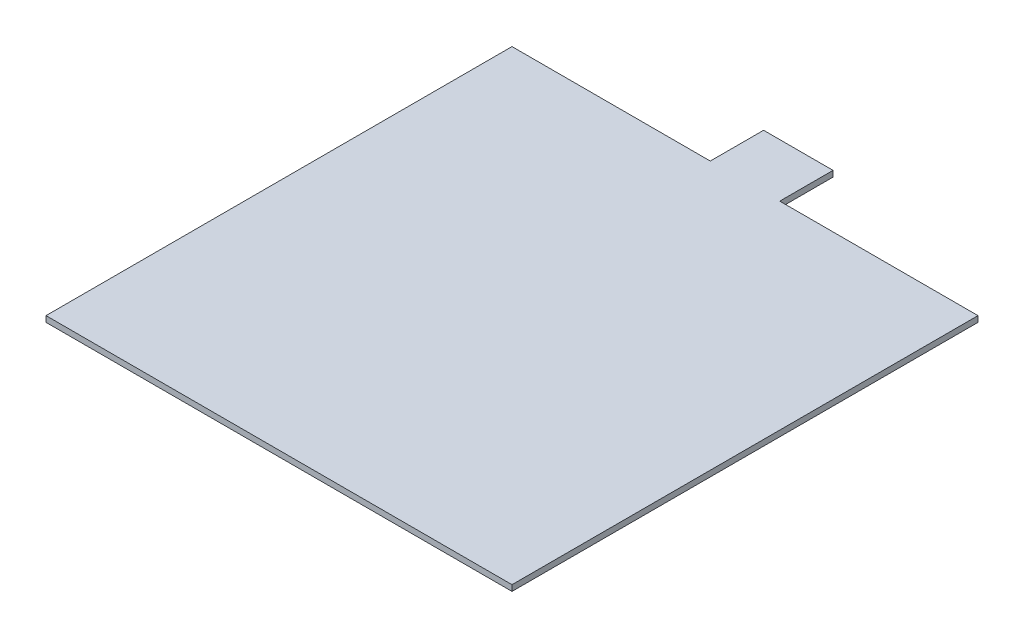
ISO-10303-21;
HEADER;
FILE_DESCRIPTION(('STEP AP214'),'2;1');
FILE_NAME('part.step','',(''),(''),'','','');
FILE_SCHEMA(('AUTOMOTIVE_DESIGN { 1 0 10303 214 1 1 1 1 }'));
ENDSEC;
DATA;
#1=APPLICATION_CONTEXT('core data for automotive mechanical design processes');
#2=APPLICATION_PROTOCOL_DEFINITION('international standard','automotive_design',2000,#1);
#3=PRODUCT_CONTEXT('',#1,'mechanical');
#4=PRODUCT('Part','Part','',(#3));
#5=PRODUCT_RELATED_PRODUCT_CATEGORY('part','',(#4));
#6=PRODUCT_DEFINITION_FORMATION('','',#4);
#7=PRODUCT_DEFINITION_CONTEXT('part definition',#1,'design');
#8=PRODUCT_DEFINITION('design','',#6,#7);
#9=PRODUCT_DEFINITION_SHAPE('','',#8);
#10=(LENGTH_UNIT() NAMED_UNIT(*) SI_UNIT(.MILLI.,.METRE.));
#11=(NAMED_UNIT(*) PLANE_ANGLE_UNIT() SI_UNIT($,.RADIAN.));
#12=(NAMED_UNIT(*) SI_UNIT($,.STERADIAN.) SOLID_ANGLE_UNIT());
#13=UNCERTAINTY_MEASURE_WITH_UNIT(LENGTH_MEASURE(1.E-05),#10,'distance_accuracy_value','');
#14=(GEOMETRIC_REPRESENTATION_CONTEXT(3) GLOBAL_UNCERTAINTY_ASSIGNED_CONTEXT((#13)) GLOBAL_UNIT_ASSIGNED_CONTEXT((#10,
#11,#12)) REPRESENTATION_CONTEXT('',''));
#15=CARTESIAN_POINT('',(0.,0.,0.));
#16=DIRECTION('',(0.,0.,1.));
#17=DIRECTION('',(1.,0.,0.));
#18=AXIS2_PLACEMENT_3D('',#15,#16,#17);
#19=CARTESIAN_POINT('',(-21.85,0.55,-21.85));
#20=DIRECTION('',(0.,0.,1.));
#21=DIRECTION('',(1.,0.,0.));
#22=AXIS2_PLACEMENT_3D('',#19,#20,#21);
#23=PLANE('',#22);
#24=DIRECTION('',(0.,-1.,0.));
#25=VECTOR('',#24,1.);
#26=CARTESIAN_POINT('',(3.2563817456186,0.55,-21.85));
#27=LINE('',#26,#25);
#28=CARTESIAN_POINT('',(3.2563817456186,0.55,-21.85));
#29=VERTEX_POINT('',#28);
#30=CARTESIAN_POINT('',(3.2563817456186,0.,-21.85));
#31=VERTEX_POINT('',#30);
#32=EDGE_CURVE('E137',#29,#31,#27,.T.);
#33=ORIENTED_EDGE('',*,*,#32,.F.);
#34=DIRECTION('',(-1.,0.,0.));
#35=VECTOR('',#34,1.);
#36=CARTESIAN_POINT('',(-21.85,0.55,-21.85));
#37=LINE('',#36,#35);
#38=CARTESIAN_POINT('',(21.85,0.55,-21.85));
#39=VERTEX_POINT('',#38);
#40=EDGE_CURVE('E96',#39,#29,#37,.T.);
#41=ORIENTED_EDGE('',*,*,#40,.F.);
#42=DIRECTION('',(0.,-1.,0.));
#43=VECTOR('',#42,1.);
#44=CARTESIAN_POINT('',(21.85,0.55,-21.85));
#45=LINE('',#44,#43);
#46=CARTESIAN_POINT('',(21.85,0.,-21.85));
#47=VERTEX_POINT('',#46);
#48=EDGE_CURVE('E11',#39,#47,#45,.T.);
#49=ORIENTED_EDGE('',*,*,#48,.T.);
#50=DIRECTION('',(-1.,0.,0.));
#51=VECTOR('',#50,1.);
#52=CARTESIAN_POINT('',(-21.85,0.,-21.85));
#53=LINE('',#52,#51);
#54=EDGE_CURVE('E159',#47,#31,#53,.T.);
#55=ORIENTED_EDGE('',*,*,#54,.T.);
#56=EDGE_LOOP('',(#33,#41,#49,#55));
#57=FACE_BOUND('',#56,.T.);
#58=ADVANCED_FACE('F43',(#57),#23,.F.);
#59=CARTESIAN_POINT('',(21.85,0.55,21.85));
#60=DIRECTION('',(-1.,0.,0.));
#61=DIRECTION('',(0.,0.,1.));
#62=AXIS2_PLACEMENT_3D('',#59,#60,#61);
#63=PLANE('',#62);
#64=DIRECTION('',(0.,0.,-1.));
#65=VECTOR('',#64,1.);
#66=CARTESIAN_POINT('',(21.85,0.,21.85));
#67=LINE('',#66,#65);
#68=CARTESIAN_POINT('',(21.85,0.,21.85));
#69=VERTEX_POINT('',#68);
#70=EDGE_CURVE('E136',#69,#47,#67,.T.);
#71=ORIENTED_EDGE('',*,*,#70,.T.);
#72=ORIENTED_EDGE('',*,*,#48,.F.);
#73=DIRECTION('',(0.,0.,-1.));
#74=VECTOR('',#73,1.);
#75=CARTESIAN_POINT('',(21.85,0.55,21.85));
#76=LINE('',#75,#74);
#77=CARTESIAN_POINT('',(21.85,0.55,21.85));
#78=VERTEX_POINT('',#77);
#79=EDGE_CURVE('E143',#78,#39,#76,.T.);
#80=ORIENTED_EDGE('',*,*,#79,.F.);
#81=DIRECTION('',(0.,-1.,0.));
#82=VECTOR('',#81,1.);
#83=CARTESIAN_POINT('',(21.85,0.55,21.85));
#84=LINE('',#83,#82);
#85=EDGE_CURVE('E154',#78,#69,#84,.T.);
#86=ORIENTED_EDGE('',*,*,#85,.T.);
#87=EDGE_LOOP('',(#71,#72,#80,#86));
#88=FACE_BOUND('',#87,.T.);
#89=ADVANCED_FACE('F45',(#88),#63,.F.);
#90=CARTESIAN_POINT('',(-3.2563817456186,0.55,-21.85));
#91=VERTEX_POINT('',#90);
#92=CARTESIAN_POINT('',(-21.85,0.55,-21.85));
#93=VERTEX_POINT('',#92);
#94=EDGE_CURVE('E122',#91,#93,#37,.T.);
#95=ORIENTED_EDGE('',*,*,#94,.F.);
#96=DIRECTION('',(0.,-1.,0.));
#97=VECTOR('',#96,1.);
#98=CARTESIAN_POINT('',(-3.2563817456186,0.55,-21.85));
#99=LINE('',#98,#97);
#100=CARTESIAN_POINT('',(-3.2563817456186,0.,-21.85));
#101=VERTEX_POINT('',#100);
#102=EDGE_CURVE('E131',#91,#101,#99,.T.);
#103=ORIENTED_EDGE('',*,*,#102,.T.);
#104=CARTESIAN_POINT('',(-21.85,0.,-21.85));
#105=VERTEX_POINT('',#104);
#106=EDGE_CURVE('E158',#101,#105,#53,.T.);
#107=ORIENTED_EDGE('',*,*,#106,.T.);
#108=DIRECTION('',(0.,-1.,0.));
#109=VECTOR('',#108,1.);
#110=CARTESIAN_POINT('',(-21.85,0.55,-21.85));
#111=LINE('',#110,#109);
#112=EDGE_CURVE('E52',#93,#105,#111,.T.);
#113=ORIENTED_EDGE('',*,*,#112,.F.);
#114=EDGE_LOOP('',(#95,#103,#107,#113));
#115=FACE_BOUND('',#114,.T.);
#116=ADVANCED_FACE('F139',(#115),#23,.F.);
#117=CARTESIAN_POINT('',(-21.85,0.55,21.85));
#118=DIRECTION('',(1.,0.,0.));
#119=DIRECTION('',(0.,0.,-1.));
#120=AXIS2_PLACEMENT_3D('',#117,#118,#119);
#121=PLANE('',#120);
#122=DIRECTION('',(0.,0.,1.));
#123=VECTOR('',#122,1.);
#124=CARTESIAN_POINT('',(-21.85,0.,21.85));
#125=LINE('',#124,#123);
#126=CARTESIAN_POINT('',(-21.85,0.,21.85));
#127=VERTEX_POINT('',#126);
#128=EDGE_CURVE('E163',#105,#127,#125,.T.);
#129=ORIENTED_EDGE('',*,*,#128,.T.);
#130=DIRECTION('',(0.,-1.,0.));
#131=VECTOR('',#130,1.);
#132=CARTESIAN_POINT('',(-21.85,0.55,21.85));
#133=LINE('',#132,#131);
#134=CARTESIAN_POINT('',(-21.85,0.55,21.85));
#135=VERTEX_POINT('',#134);
#136=EDGE_CURVE('E170',#135,#127,#133,.T.);
#137=ORIENTED_EDGE('',*,*,#136,.F.);
#138=DIRECTION('',(0.,0.,1.));
#139=VECTOR('',#138,1.);
#140=CARTESIAN_POINT('',(-21.85,0.55,21.85));
#141=LINE('',#140,#139);
#142=EDGE_CURVE('E147',#93,#135,#141,.T.);
#143=ORIENTED_EDGE('',*,*,#142,.F.);
#144=ORIENTED_EDGE('',*,*,#112,.T.);
#145=EDGE_LOOP('',(#129,#137,#143,#144));
#146=FACE_BOUND('',#145,.T.);
#147=ADVANCED_FACE('F175',(#146),#121,.F.);
#148=CARTESIAN_POINT('',(-21.85,0.55,21.85));
#149=DIRECTION('',(0.,0.,-1.));
#150=DIRECTION('',(-1.,0.,0.));
#151=AXIS2_PLACEMENT_3D('',#148,#149,#150);
#152=PLANE('',#151);
#153=DIRECTION('',(1.,0.,0.));
#154=VECTOR('',#153,1.);
#155=CARTESIAN_POINT('',(-21.85,0.,21.85));
#156=LINE('',#155,#154);
#157=EDGE_CURVE('E89',#127,#69,#156,.T.);
#158=ORIENTED_EDGE('',*,*,#157,.T.);
#159=ORIENTED_EDGE('',*,*,#85,.F.);
#160=DIRECTION('',(1.,0.,0.));
#161=VECTOR('',#160,1.);
#162=CARTESIAN_POINT('',(-21.85,0.55,21.85));
#163=LINE('',#162,#161);
#164=EDGE_CURVE('E68',#135,#78,#163,.T.);
#165=ORIENTED_EDGE('',*,*,#164,.F.);
#166=ORIENTED_EDGE('',*,*,#136,.T.);
#167=EDGE_LOOP('',(#158,#159,#165,#166));
#168=FACE_BOUND('',#167,.T.);
#169=ADVANCED_FACE('F184',(#168),#152,.F.);
#170=CARTESIAN_POINT('',(0.,0.55,0.));
#171=DIRECTION('',(0.,-1.,0.));
#172=DIRECTION('',(0.,0.,-1.));
#173=AXIS2_PLACEMENT_3D('',#170,#171,#172);
#174=PLANE('',#173);
#175=ORIENTED_EDGE('',*,*,#79,.T.);
#176=ORIENTED_EDGE('',*,*,#40,.T.);
#177=DIRECTION('',(0.,0.,-1.));
#178=VECTOR('',#177,1.);
#179=CARTESIAN_POINT('',(3.2563817456186,0.55,-21.85));
#180=LINE('',#179,#178);
#181=CARTESIAN_POINT('',(3.2563817456186,0.55,-26.85));
#182=VERTEX_POINT('',#181);
#183=EDGE_CURVE('E128',#29,#182,#180,.T.);
#184=ORIENTED_EDGE('',*,*,#183,.T.);
#185=DIRECTION('',(-1.,0.,0.));
#186=VECTOR('',#185,1.);
#187=CARTESIAN_POINT('',(-3.2563817456186,0.55,-26.85));
#188=LINE('',#187,#186);
#189=CARTESIAN_POINT('',(-3.2563817456186,0.55,-26.85));
#190=VERTEX_POINT('',#189);
#191=EDGE_CURVE('E125',#182,#190,#188,.T.);
#192=ORIENTED_EDGE('',*,*,#191,.T.);
#193=DIRECTION('',(0.,0.,1.));
#194=VECTOR('',#193,1.);
#195=CARTESIAN_POINT('',(-3.2563817456186,0.55,-21.85));
#196=LINE('',#195,#194);
#197=EDGE_CURVE('E119',#190,#91,#196,.T.);
#198=ORIENTED_EDGE('',*,*,#197,.T.);
#199=ORIENTED_EDGE('',*,*,#94,.T.);
#200=ORIENTED_EDGE('',*,*,#142,.T.);
#201=ORIENTED_EDGE('',*,*,#164,.T.);
#202=EDGE_LOOP('',(#175,#176,#184,#192,#198,#199,#200,#201));
#203=FACE_BOUND('',#202,.T.);
#204=ADVANCED_FACE('F120',(#203),#174,.F.);
#205=CARTESIAN_POINT('',(0.,0.,0.));
#206=DIRECTION('',(0.,-1.,0.));
#207=DIRECTION('',(0.,0.,-1.));
#208=AXIS2_PLACEMENT_3D('',#205,#206,#207);
#209=PLANE('',#208);
#210=ORIENTED_EDGE('',*,*,#70,.F.);
#211=ORIENTED_EDGE('',*,*,#157,.F.);
#212=ORIENTED_EDGE('',*,*,#128,.F.);
#213=ORIENTED_EDGE('',*,*,#106,.F.);
#214=DIRECTION('',(0.,0.,1.));
#215=VECTOR('',#214,1.);
#216=CARTESIAN_POINT('',(-3.2563817456186,0.,-21.85));
#217=LINE('',#216,#215);
#218=CARTESIAN_POINT('',(-3.2563817456186,0.,-26.85));
#219=VERTEX_POINT('',#218);
#220=EDGE_CURVE('E59',#219,#101,#217,.T.);
#221=ORIENTED_EDGE('',*,*,#220,.F.);
#222=DIRECTION('',(-1.,0.,0.));
#223=VECTOR('',#222,1.);
#224=CARTESIAN_POINT('',(-3.2563817456186,0.,-26.85));
#225=LINE('',#224,#223);
#226=CARTESIAN_POINT('',(3.2563817456186,0.,-26.85));
#227=VERTEX_POINT('',#226);
#228=EDGE_CURVE('E129',#227,#219,#225,.T.);
#229=ORIENTED_EDGE('',*,*,#228,.F.);
#230=DIRECTION('',(0.,0.,-1.));
#231=VECTOR('',#230,1.);
#232=CARTESIAN_POINT('',(3.2563817456186,0.,-21.85));
#233=LINE('',#232,#231);
#234=EDGE_CURVE('E286',#31,#227,#233,.T.);
#235=ORIENTED_EDGE('',*,*,#234,.F.);
#236=ORIENTED_EDGE('',*,*,#54,.F.);
#237=EDGE_LOOP('',(#210,#211,#212,#213,#221,#229,#235,#236));
#238=FACE_BOUND('',#237,.T.);
#239=ADVANCED_FACE('F179',(#238),#209,.T.);
#240=CARTESIAN_POINT('',(-3.2563817456186,0.55,-21.85));
#241=DIRECTION('',(1.,0.,0.));
#242=DIRECTION('',(0.,0.,-1.));
#243=AXIS2_PLACEMENT_3D('',#240,#241,#242);
#244=PLANE('',#243);
#245=ORIENTED_EDGE('',*,*,#220,.T.);
#246=ORIENTED_EDGE('',*,*,#102,.F.);
#247=ORIENTED_EDGE('',*,*,#197,.F.);
#248=DIRECTION('',(0.,-1.,0.));
#249=VECTOR('',#248,1.);
#250=CARTESIAN_POINT('',(-3.2563817456186,0.55,-26.85));
#251=LINE('',#250,#249);
#252=EDGE_CURVE('E282',#190,#219,#251,.T.);
#253=ORIENTED_EDGE('',*,*,#252,.T.);
#254=EDGE_LOOP('',(#245,#246,#247,#253));
#255=FACE_BOUND('',#254,.T.);
#256=ADVANCED_FACE('F132',(#255),#244,.F.);
#257=CARTESIAN_POINT('',(3.2563817456186,0.55,-21.85));
#258=DIRECTION('',(-1.,0.,0.));
#259=DIRECTION('',(0.,0.,1.));
#260=AXIS2_PLACEMENT_3D('',#257,#258,#259);
#261=PLANE('',#260);
#262=ORIENTED_EDGE('',*,*,#234,.T.);
#263=DIRECTION('',(0.,-1.,0.));
#264=VECTOR('',#263,1.);
#265=CARTESIAN_POINT('',(3.2563817456186,0.55,-26.85));
#266=LINE('',#265,#264);
#267=EDGE_CURVE('E284',#182,#227,#266,.T.);
#268=ORIENTED_EDGE('',*,*,#267,.F.);
#269=ORIENTED_EDGE('',*,*,#183,.F.);
#270=ORIENTED_EDGE('',*,*,#32,.T.);
#271=EDGE_LOOP('',(#262,#268,#269,#270));
#272=FACE_BOUND('',#271,.T.);
#273=ADVANCED_FACE('F251',(#272),#261,.F.);
#274=CARTESIAN_POINT('',(-3.2563817456186,0.55,-26.85));
#275=DIRECTION('',(0.,0.,1.));
#276=DIRECTION('',(1.,0.,0.));
#277=AXIS2_PLACEMENT_3D('',#274,#275,#276);
#278=PLANE('',#277);
#279=ORIENTED_EDGE('',*,*,#228,.T.);
#280=ORIENTED_EDGE('',*,*,#252,.F.);
#281=ORIENTED_EDGE('',*,*,#191,.F.);
#282=ORIENTED_EDGE('',*,*,#267,.T.);
#283=EDGE_LOOP('',(#279,#280,#281,#282));
#284=FACE_BOUND('',#283,.T.);
#285=ADVANCED_FACE('F261',(#284),#278,.F.);
#286=CLOSED_SHELL('',(#58,#89,#116,#147,#169,#204,#239,#256,#273,#285));
#287=MANIFOLD_SOLID_BREP('B2',#286);
#288=ADVANCED_BREP_SHAPE_REPRESENTATION('',(#18,#287),#14);
#289=SHAPE_DEFINITION_REPRESENTATION(#9,#288);
ENDSEC;
END-ISO-10303-21;
